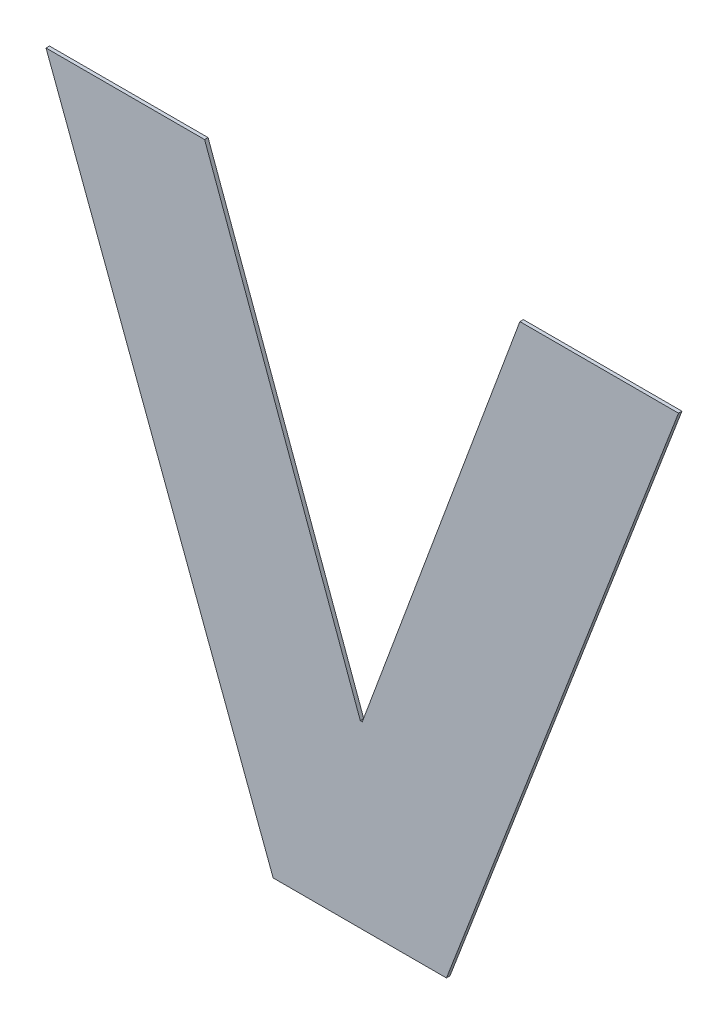
ISO-10303-21;
HEADER;
FILE_DESCRIPTION(('STEP AP214'),'2;1');
FILE_NAME('part.step','',(''),(''),'','','');
FILE_SCHEMA(('AUTOMOTIVE_DESIGN { 1 0 10303 214 1 1 1 1 }'));
ENDSEC;
DATA;
#1=APPLICATION_CONTEXT('core data for automotive mechanical design processes');
#2=APPLICATION_PROTOCOL_DEFINITION('international standard','automotive_design',2000,#1);
#3=PRODUCT_CONTEXT('',#1,'mechanical');
#4=PRODUCT('Part','Part','',(#3));
#5=PRODUCT_RELATED_PRODUCT_CATEGORY('part','',(#4));
#6=PRODUCT_DEFINITION_FORMATION('','',#4);
#7=PRODUCT_DEFINITION_CONTEXT('part definition',#1,'design');
#8=PRODUCT_DEFINITION('design','',#6,#7);
#9=PRODUCT_DEFINITION_SHAPE('','',#8);
#10=(LENGTH_UNIT() NAMED_UNIT(*) SI_UNIT(.MILLI.,.METRE.));
#11=(NAMED_UNIT(*) PLANE_ANGLE_UNIT() SI_UNIT($,.RADIAN.));
#12=(NAMED_UNIT(*) SI_UNIT($,.STERADIAN.) SOLID_ANGLE_UNIT());
#13=UNCERTAINTY_MEASURE_WITH_UNIT(LENGTH_MEASURE(1.E-05),#10,'distance_accuracy_value','');
#14=(GEOMETRIC_REPRESENTATION_CONTEXT(3) GLOBAL_UNCERTAINTY_ASSIGNED_CONTEXT((#13)) GLOBAL_UNIT_ASSIGNED_CONTEXT((#10,
#11,#12)) REPRESENTATION_CONTEXT('',''));
#15=CARTESIAN_POINT('',(0.,0.,0.));
#16=DIRECTION('',(0.,0.,1.));
#17=DIRECTION('',(1.,0.,0.));
#18=AXIS2_PLACEMENT_3D('',#15,#16,#17);
#19=CARTESIAN_POINT('',(-0.39641548167405,0.5836626607169,0.0009));
#20=DIRECTION('',(0.,-1.,0.));
#21=DIRECTION('',(0.,0.,-1.));
#22=AXIS2_PLACEMENT_3D('',#19,#20,#21);
#23=PLANE('',#22);
#24=DIRECTION('',(0.,0.,1.));
#25=VECTOR('',#24,1.);
#26=CARTESIAN_POINT('',(-0.373855830324,0.5836626607169,0.));
#27=LINE('',#26,#25);
#28=CARTESIAN_POINT('',(-0.373855830324,0.5836626607169,0.));
#29=VERTEX_POINT('',#28);
#30=CARTESIAN_POINT('',(-0.373855830324,0.5836626607169,0.0009));
#31=VERTEX_POINT('',#30);
#32=EDGE_CURVE('E11',#29,#31,#27,.T.);
#33=ORIENTED_EDGE('',*,*,#32,.T.);
#34=DIRECTION('',(-1.,0.,0.));
#35=VECTOR('',#34,1.);
#36=CARTESIAN_POINT('',(-0.373855830324,0.5836626607169,0.0009));
#37=LINE('',#36,#35);
#38=CARTESIAN_POINT('',(-0.4189751330241,0.5836626607169,0.0009));
#39=VERTEX_POINT('',#38);
#40=EDGE_CURVE('E143',#31,#39,#37,.T.);
#41=ORIENTED_EDGE('',*,*,#40,.T.);
#42=DIRECTION('',(0.,0.,1.));
#43=VECTOR('',#42,1.);
#44=CARTESIAN_POINT('',(-0.4189751330241,0.5836626607169,0.));
#45=LINE('',#44,#43);
#46=CARTESIAN_POINT('',(-0.4189751330241,0.5836626607169,0.));
#47=VERTEX_POINT('',#46);
#48=EDGE_CURVE('E24',#47,#39,#45,.T.);
#49=ORIENTED_EDGE('',*,*,#48,.F.);
#50=DIRECTION('',(-1.,0.,0.));
#51=VECTOR('',#50,1.);
#52=CARTESIAN_POINT('',(-0.373855830324,0.5836626607169,0.));
#53=LINE('',#52,#51);
#54=EDGE_CURVE('E132',#29,#47,#53,.T.);
#55=ORIENTED_EDGE('',*,*,#54,.F.);
#56=EDGE_LOOP('',(#33,#41,#49,#55));
#57=FACE_BOUND('',#56,.T.);
#58=ADVANCED_FACE('F17',(#57),#23,.T.);
#59=CARTESIAN_POINT('',(-0.448546079724,0.662452825082,0.0009));
#60=DIRECTION('',(-0.936232902766256,-0.351380067416851,0.));
#61=DIRECTION('',(0.,0.,1.));
#62=AXIS2_PLACEMENT_3D('',#59,#60,#61);
#63=PLANE('',#62);
#64=ORIENTED_EDGE('',*,*,#48,.T.);
#65=DIRECTION('',(-0.351380067416851,0.936232902766256,0.));
#66=VECTOR('',#65,1.);
#67=CARTESIAN_POINT('',(-0.4189751330241,0.5836626607169,0.0009));
#68=LINE('',#67,#66);
#69=CARTESIAN_POINT('',(-0.4781170264239,0.7412429894471,0.0009));
#70=VERTEX_POINT('',#69);
#71=EDGE_CURVE('E139',#39,#70,#68,.T.);
#72=ORIENTED_EDGE('',*,*,#71,.T.);
#73=DIRECTION('',(0.,0.,1.));
#74=VECTOR('',#73,1.);
#75=CARTESIAN_POINT('',(-0.4781170264239,0.7412429894471,0.));
#76=LINE('',#75,#74);
#77=CARTESIAN_POINT('',(-0.4781170264239,0.7412429894471,0.));
#78=VERTEX_POINT('',#77);
#79=EDGE_CURVE('E141',#78,#70,#76,.T.);
#80=ORIENTED_EDGE('',*,*,#79,.F.);
#81=DIRECTION('',(-0.351380067416851,0.936232902766256,0.));
#82=VECTOR('',#81,1.);
#83=CARTESIAN_POINT('',(-0.4189751330241,0.5836626607169,0.));
#84=LINE('',#83,#82);
#85=EDGE_CURVE('E124',#47,#78,#84,.T.);
#86=ORIENTED_EDGE('',*,*,#85,.F.);
#87=EDGE_LOOP('',(#64,#72,#80,#86));
#88=FACE_BOUND('',#87,.T.);
#89=ADVANCED_FACE('F150',(#88),#63,.T.);
#90=CARTESIAN_POINT('',(-0.45747120157395,0.7412429894471,0.0009));
#91=DIRECTION('',(0.,1.,0.));
#92=DIRECTION('',(0.,0.,1.));
#93=AXIS2_PLACEMENT_3D('',#90,#91,#92);
#94=PLANE('',#93);
#95=ORIENTED_EDGE('',*,*,#79,.T.);
#96=DIRECTION('',(1.,0.,0.));
#97=VECTOR('',#96,1.);
#98=CARTESIAN_POINT('',(-0.4781170264239,0.7412429894471,0.0009));
#99=LINE('',#98,#97);
#100=CARTESIAN_POINT('',(-0.436825376724,0.7412429894471,0.0009));
#101=VERTEX_POINT('',#100);
#102=EDGE_CURVE('E134',#70,#101,#99,.T.);
#103=ORIENTED_EDGE('',*,*,#102,.T.);
#104=DIRECTION('',(0.,0.,1.));
#105=VECTOR('',#104,1.);
#106=CARTESIAN_POINT('',(-0.436825376724,0.7412429894471,0.));
#107=LINE('',#106,#105);
#108=CARTESIAN_POINT('',(-0.436825376724,0.7412429894471,0.));
#109=VERTEX_POINT('',#108);
#110=EDGE_CURVE('E137',#109,#101,#107,.T.);
#111=ORIENTED_EDGE('',*,*,#110,.F.);
#112=DIRECTION('',(1.,0.,0.));
#113=VECTOR('',#112,1.);
#114=CARTESIAN_POINT('',(-0.4781170264239,0.7412429894471,0.));
#115=LINE('',#114,#113);
#116=EDGE_CURVE('E116',#78,#109,#115,.T.);
#117=ORIENTED_EDGE('',*,*,#116,.F.);
#118=EDGE_LOOP('',(#95,#103,#111,#117));
#119=FACE_BOUND('',#118,.T.);
#120=ADVANCED_FACE('F153',(#119),#94,.T.);
#121=CARTESIAN_POINT('',(-0.416555414724,0.685859685812,0.0009));
#122=DIRECTION('',(0.939080291965946,0.343697840029804,0.));
#123=DIRECTION('',(0.,0.,-1.));
#124=AXIS2_PLACEMENT_3D('',#121,#122,#123);
#125=PLANE('',#124);
#126=ORIENTED_EDGE('',*,*,#110,.T.);
#127=DIRECTION('',(0.343697840029804,-0.939080291965946,0.));
#128=VECTOR('',#127,1.);
#129=CARTESIAN_POINT('',(-0.436825376724,0.7412429894471,0.0009));
#130=LINE('',#129,#128);
#131=CARTESIAN_POINT('',(-0.396285452724,0.6304763821769,0.0009));
#132=VERTEX_POINT('',#131);
#133=EDGE_CURVE('E127',#101,#132,#130,.T.);
#134=ORIENTED_EDGE('',*,*,#133,.T.);
#135=DIRECTION('',(0.,1.2335811384724E-13,1.));
#136=VECTOR('',#135,1.);
#137=CARTESIAN_POINT('',(-0.396285452724,0.6304763821769,0.));
#138=LINE('',#137,#136);
#139=CARTESIAN_POINT('',(-0.396285452724,0.6304763821769,0.));
#140=VERTEX_POINT('',#139);
#141=EDGE_CURVE('E130',#140,#132,#138,.T.);
#142=ORIENTED_EDGE('',*,*,#141,.F.);
#143=DIRECTION('',(0.343697840029804,-0.939080291965946,0.));
#144=VECTOR('',#143,1.);
#145=CARTESIAN_POINT('',(-0.436825376724,0.7412429894471,0.));
#146=LINE('',#145,#144);
#147=EDGE_CURVE('E89',#109,#140,#146,.T.);
#148=ORIENTED_EDGE('',*,*,#147,.F.);
#149=EDGE_LOOP('',(#126,#134,#142,#148));
#150=FACE_BOUND('',#149,.T.);
#151=ADVANCED_FACE('F157',(#150),#125,.T.);
#152=CARTESIAN_POINT('',(-0.396031497174,0.6304763821769,0.0009));
#153=DIRECTION('',(0.,1.,0.));
#154=DIRECTION('',(0.,0.,1.));
#155=AXIS2_PLACEMENT_3D('',#152,#153,#154);
#156=PLANE('',#155);
#157=ORIENTED_EDGE('',*,*,#141,.T.);
#158=DIRECTION('',(1.,0.,0.));
#159=VECTOR('',#158,1.);
#160=CARTESIAN_POINT('',(-0.396285452724,0.6304763821769,0.0009));
#161=LINE('',#160,#159);
#162=CARTESIAN_POINT('',(-0.395777541624,0.6304763821769,0.0009));
#163=VERTEX_POINT('',#162);
#164=EDGE_CURVE('E119',#132,#163,#161,.T.);
#165=ORIENTED_EDGE('',*,*,#164,.T.);
#166=DIRECTION('',(0.,1.2335811384724E-13,1.));
#167=VECTOR('',#166,1.);
#168=CARTESIAN_POINT('',(-0.395777541624,0.6304763821769,0.));
#169=LINE('',#168,#167);
#170=CARTESIAN_POINT('',(-0.395777541624,0.6304763821769,0.));
#171=VERTEX_POINT('',#170);
#172=EDGE_CURVE('E122',#171,#163,#169,.T.);
#173=ORIENTED_EDGE('',*,*,#172,.F.);
#174=DIRECTION('',(1.,0.,0.));
#175=VECTOR('',#174,1.);
#176=CARTESIAN_POINT('',(-0.396285452724,0.6304763821769,0.));
#177=LINE('',#176,#175);
#178=EDGE_CURVE('E106',#140,#171,#177,.T.);
#179=ORIENTED_EDGE('',*,*,#178,.F.);
#180=EDGE_LOOP('',(#157,#165,#173,#179));
#181=FACE_BOUND('',#180,.T.);
#182=ADVANCED_FACE('F160',(#181),#156,.T.);
#183=CARTESIAN_POINT('',(-0.37525564972395,0.685859685812,0.0009));
#184=DIRECTION('',(-0.937696048296048,0.34745664623083,0.));
#185=DIRECTION('',(0.,0.,1.));
#186=AXIS2_PLACEMENT_3D('',#183,#184,#185);
#187=PLANE('',#186);
#188=ORIENTED_EDGE('',*,*,#172,.T.);
#189=DIRECTION('',(0.34745664623083,0.937696048296048,0.));
#190=VECTOR('',#189,1.);
#191=CARTESIAN_POINT('',(-0.395777541624,0.6304763821769,0.0009));
#192=LINE('',#191,#190);
#193=CARTESIAN_POINT('',(-0.3547337578239,0.7412429894471,0.0009));
#194=VERTEX_POINT('',#193);
#195=EDGE_CURVE('E111',#163,#194,#192,.T.);
#196=ORIENTED_EDGE('',*,*,#195,.T.);
#197=DIRECTION('',(0.,0.,1.));
#198=VECTOR('',#197,1.);
#199=CARTESIAN_POINT('',(-0.3547337578239,0.7412429894471,0.));
#200=LINE('',#199,#198);
#201=CARTESIAN_POINT('',(-0.3547337578239,0.7412429894471,0.));
#202=VERTEX_POINT('',#201);
#203=EDGE_CURVE('E114',#202,#194,#200,.T.);
#204=ORIENTED_EDGE('',*,*,#203,.F.);
#205=DIRECTION('',(0.34745664623083,0.937696048296048,0.));
#206=VECTOR('',#205,1.);
#207=CARTESIAN_POINT('',(-0.395777541624,0.6304763821769,0.));
#208=LINE('',#207,#206);
#209=EDGE_CURVE('E100',#171,#202,#208,.T.);
#210=ORIENTED_EDGE('',*,*,#209,.F.);
#211=EDGE_LOOP('',(#188,#196,#204,#210));
#212=FACE_BOUND('',#211,.T.);
#213=ADVANCED_FACE('F163',(#212),#187,.T.);
#214=CARTESIAN_POINT('',(-0.33408183697395,0.7412429894471,0.0009));
#215=DIRECTION('',(0.,1.,0.));
#216=DIRECTION('',(0.,0.,1.));
#217=AXIS2_PLACEMENT_3D('',#214,#215,#216);
#218=PLANE('',#217);
#219=ORIENTED_EDGE('',*,*,#203,.T.);
#220=DIRECTION('',(1.,0.,0.));
#221=VECTOR('',#220,1.);
#222=CARTESIAN_POINT('',(-0.3547337578239,0.7412429894471,0.0009));
#223=LINE('',#222,#221);
#224=CARTESIAN_POINT('',(-0.313429916124,0.7412429894471,0.0009));
#225=VERTEX_POINT('',#224);
#226=EDGE_CURVE('E86',#194,#225,#223,.T.);
#227=ORIENTED_EDGE('',*,*,#226,.T.);
#228=DIRECTION('',(0.,0.,1.));
#229=VECTOR('',#228,1.);
#230=CARTESIAN_POINT('',(-0.313429916124,0.7412429894471,0.));
#231=LINE('',#230,#229);
#232=CARTESIAN_POINT('',(-0.313429916124,0.7412429894471,0.));
#233=VERTEX_POINT('',#232);
#234=EDGE_CURVE('E79',#233,#225,#231,.T.);
#235=ORIENTED_EDGE('',*,*,#234,.F.);
#236=DIRECTION('',(1.,0.,0.));
#237=VECTOR('',#236,1.);
#238=CARTESIAN_POINT('',(-0.3547337578239,0.7412429894471,0.));
#239=LINE('',#238,#237);
#240=EDGE_CURVE('E83',#202,#233,#239,.T.);
#241=ORIENTED_EDGE('',*,*,#240,.F.);
#242=EDGE_LOOP('',(#219,#227,#235,#241));
#243=FACE_BOUND('',#242,.T.);
#244=ADVANCED_FACE('F81',(#243),#218,.T.);
#245=CARTESIAN_POINT('',(-0.343642873224,0.662452825082,0.0009));
#246=DIRECTION('',(0.933706263815722,-0.358039959936437,0.));
#247=DIRECTION('',(0.,0.,-1.));
#248=AXIS2_PLACEMENT_3D('',#245,#246,#247);
#249=PLANE('',#248);
#250=ORIENTED_EDGE('',*,*,#234,.T.);
#251=DIRECTION('',(-0.358039959936437,-0.933706263815722,0.));
#252=VECTOR('',#251,1.);
#253=CARTESIAN_POINT('',(-0.313429916124,0.7412429894471,0.0009));
#254=LINE('',#253,#252);
#255=EDGE_CURVE('E102',#225,#31,#254,.T.);
#256=ORIENTED_EDGE('',*,*,#255,.T.);
#257=ORIENTED_EDGE('',*,*,#32,.F.);
#258=DIRECTION('',(-0.358039959936437,-0.933706263815722,0.));
#259=VECTOR('',#258,1.);
#260=CARTESIAN_POINT('',(-0.313429916124,0.7412429894471,0.));
#261=LINE('',#260,#259);
#262=EDGE_CURVE('E92',#233,#29,#261,.T.);
#263=ORIENTED_EDGE('',*,*,#262,.F.);
#264=EDGE_LOOP('',(#250,#256,#257,#263));
#265=FACE_BOUND('',#264,.T.);
#266=ADVANCED_FACE('F93',(#265),#249,.T.);
#267=CARTESIAN_POINT('',(-0.39577347127395,0.5836626607169,0.));
#268=DIRECTION('',(0.,0.,1.));
#269=DIRECTION('',(1.,0.,0.));
#270=AXIS2_PLACEMENT_3D('',#267,#268,#269);
#271=PLANE('',#270);
#272=ORIENTED_EDGE('',*,*,#54,.T.);
#273=ORIENTED_EDGE('',*,*,#85,.T.);
#274=ORIENTED_EDGE('',*,*,#116,.T.);
#275=ORIENTED_EDGE('',*,*,#147,.T.);
#276=ORIENTED_EDGE('',*,*,#178,.T.);
#277=ORIENTED_EDGE('',*,*,#209,.T.);
#278=ORIENTED_EDGE('',*,*,#240,.T.);
#279=ORIENTED_EDGE('',*,*,#262,.T.);
#280=EDGE_LOOP('',(#272,#273,#274,#275,#276,#277,#278,#279));
#281=FACE_BOUND('',#280,.T.);
#282=ADVANCED_FACE('F97',(#281),#271,.F.);
#283=CARTESIAN_POINT('',(-0.39577347127395,0.5836626607169,0.0009));
#284=DIRECTION('',(0.,0.,1.));
#285=DIRECTION('',(1.,0.,0.));
#286=AXIS2_PLACEMENT_3D('',#283,#284,#285);
#287=PLANE('',#286);
#288=ORIENTED_EDGE('',*,*,#40,.F.);
#289=ORIENTED_EDGE('',*,*,#255,.F.);
#290=ORIENTED_EDGE('',*,*,#226,.F.);
#291=ORIENTED_EDGE('',*,*,#195,.F.);
#292=ORIENTED_EDGE('',*,*,#164,.F.);
#293=ORIENTED_EDGE('',*,*,#133,.F.);
#294=ORIENTED_EDGE('',*,*,#102,.F.);
#295=ORIENTED_EDGE('',*,*,#71,.F.);
#296=EDGE_LOOP('',(#288,#289,#290,#291,#292,#293,#294,#295));
#297=FACE_BOUND('',#296,.T.);
#298=ADVANCED_FACE('F148',(#297),#287,.T.);
#299=CLOSED_SHELL('',(#58,#89,#120,#151,#182,#213,#244,#266,#282,#298));
#300=MANIFOLD_SOLID_BREP('B1',#299);
#301=ADVANCED_BREP_SHAPE_REPRESENTATION('',(#18,#300),#14);
#302=SHAPE_DEFINITION_REPRESENTATION(#9,#301);
ENDSEC;
END-ISO-10303-21;
